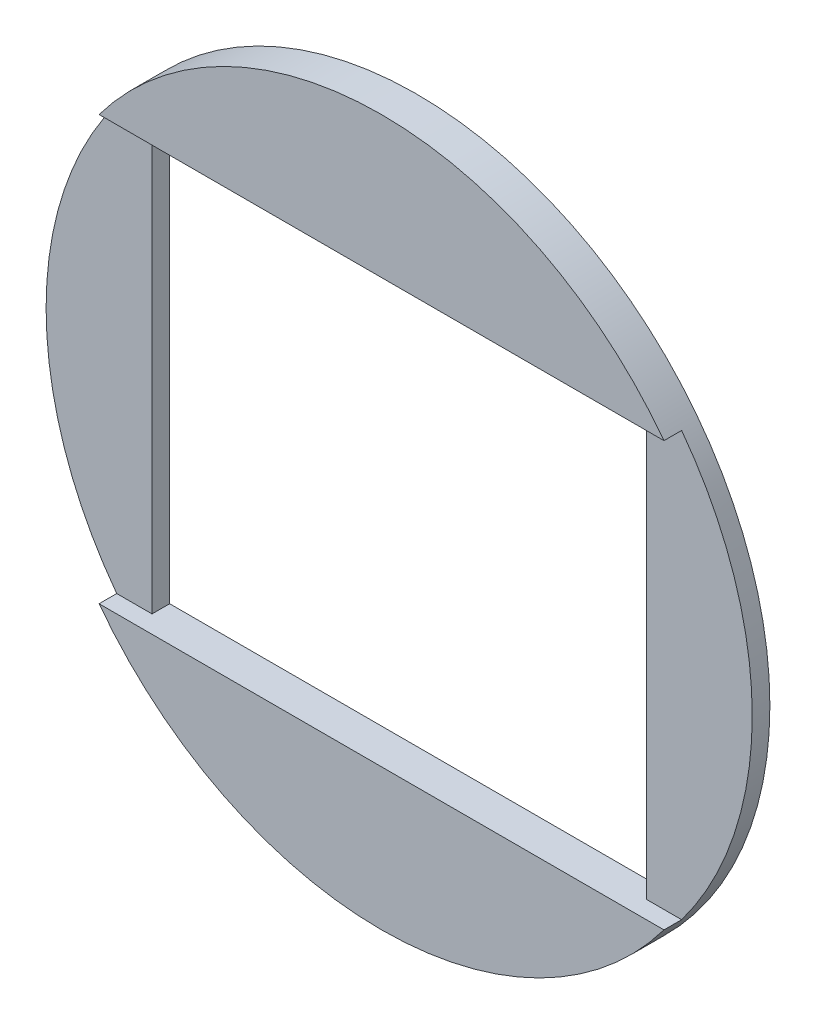
ISO-10303-21;
HEADER;
FILE_DESCRIPTION(('STEP AP214'),'2;1');
FILE_NAME('part.step','',(''),(''),'','','');
FILE_SCHEMA(('AUTOMOTIVE_DESIGN { 1 0 10303 214 1 1 1 1 }'));
ENDSEC;
DATA;
#1=APPLICATION_CONTEXT('core data for automotive mechanical design processes');
#2=APPLICATION_PROTOCOL_DEFINITION('international standard','automotive_design',2000,#1);
#3=PRODUCT_CONTEXT('',#1,'mechanical');
#4=PRODUCT('Part','Part','',(#3));
#5=PRODUCT_RELATED_PRODUCT_CATEGORY('part','',(#4));
#6=PRODUCT_DEFINITION_FORMATION('','',#4);
#7=PRODUCT_DEFINITION_CONTEXT('part definition',#1,'design');
#8=PRODUCT_DEFINITION('design','',#6,#7);
#9=PRODUCT_DEFINITION_SHAPE('','',#8);
#10=(LENGTH_UNIT() NAMED_UNIT(*) SI_UNIT(.MILLI.,.METRE.));
#11=(NAMED_UNIT(*) PLANE_ANGLE_UNIT() SI_UNIT($,.RADIAN.));
#12=(NAMED_UNIT(*) SI_UNIT($,.STERADIAN.) SOLID_ANGLE_UNIT());
#13=UNCERTAINTY_MEASURE_WITH_UNIT(LENGTH_MEASURE(1.E-05),#10,'distance_accuracy_value','');
#14=(GEOMETRIC_REPRESENTATION_CONTEXT(3) GLOBAL_UNCERTAINTY_ASSIGNED_CONTEXT((#13)) GLOBAL_UNIT_ASSIGNED_CONTEXT((#10,
#11,#12)) REPRESENTATION_CONTEXT('',''));
#15=CARTESIAN_POINT('',(0.,0.,0.));
#16=DIRECTION('',(0.,0.,1.));
#17=DIRECTION('',(1.,0.,0.));
#18=AXIS2_PLACEMENT_3D('',#15,#16,#17);
#19=CARTESIAN_POINT('',(0.,0.,1.5875));
#20=DIRECTION('',(0.,0.,1.));
#21=DIRECTION('',(1.,0.,0.));
#22=AXIS2_PLACEMENT_3D('',#19,#20,#21);
#23=PLANE('',#22);
#24=DIRECTION('',(1.,0.,0.));
#25=VECTOR('',#24,1.);
#26=CARTESIAN_POINT('',(0.,19.05,1.5875));
#27=LINE('',#26,#25);
#28=CARTESIAN_POINT('',(-25.4,19.05,1.58749999999999));
#29=VERTEX_POINT('',#28);
#30=CARTESIAN_POINT('',(25.4,19.05,1.58749999999999));
#31=VERTEX_POINT('',#30);
#32=EDGE_CURVE('E102',#29,#31,#27,.T.);
#33=ORIENTED_EDGE('',*,*,#32,.T.);
#34=CARTESIAN_POINT('',(0.,0.,1.5875));
#35=DIRECTION('',(0.,0.,1.));
#36=DIRECTION('',(1.,0.,0.));
#37=AXIS2_PLACEMENT_3D('',#34,#35,#36);
#38=CIRCLE('',#37,31.75);
#39=EDGE_CURVE('E118',#31,#29,#38,.T.);
#40=ORIENTED_EDGE('',*,*,#39,.T.);
#41=EDGE_LOOP('',(#33,#40));
#42=FACE_BOUND('',#41,.T.);
#43=ADVANCED_FACE('F36',(#42),#23,.T.);
#44=CARTESIAN_POINT('',(22.225,0.,1.5875));
#45=DIRECTION('',(-1.,0.,0.));
#46=DIRECTION('',(0.,0.,1.));
#47=AXIS2_PLACEMENT_3D('',#44,#45,#46);
#48=PLANE('',#47);
#49=DIRECTION('',(0.,-1.,0.));
#50=VECTOR('',#49,1.);
#51=CARTESIAN_POINT('',(22.225,0.,0.));
#52=LINE('',#51,#50);
#53=CARTESIAN_POINT('',(22.225,19.05,0.));
#54=VERTEX_POINT('',#53);
#55=CARTESIAN_POINT('',(22.225,-19.05,0.));
#56=VERTEX_POINT('',#55);
#57=EDGE_CURVE('E133',#54,#56,#52,.T.);
#58=ORIENTED_EDGE('',*,*,#57,.F.);
#59=DIRECTION('',(0.,0.,-1.));
#60=VECTOR('',#59,1.);
#61=CARTESIAN_POINT('',(22.225,19.05,1.5875));
#62=LINE('',#61,#60);
#63=CARTESIAN_POINT('',(22.225,19.05,-1.5875));
#64=VERTEX_POINT('',#63);
#65=EDGE_CURVE('E58',#54,#64,#62,.T.);
#66=ORIENTED_EDGE('',*,*,#65,.T.);
#67=DIRECTION('',(0.,1.,0.));
#68=VECTOR('',#67,1.);
#69=CARTESIAN_POINT('',(22.225,0.,-1.5875));
#70=LINE('',#69,#68);
#71=CARTESIAN_POINT('',(22.225,-19.05,-1.5875));
#72=VERTEX_POINT('',#71);
#73=EDGE_CURVE('E129',#72,#64,#70,.T.);
#74=ORIENTED_EDGE('',*,*,#73,.F.);
#75=DIRECTION('',(0.,0.,-1.));
#76=VECTOR('',#75,1.);
#77=CARTESIAN_POINT('',(22.225,-19.05,1.5875));
#78=LINE('',#77,#76);
#79=EDGE_CURVE('E11',#56,#72,#78,.T.);
#80=ORIENTED_EDGE('',*,*,#79,.F.);
#81=EDGE_LOOP('',(#58,#66,#74,#80));
#82=FACE_BOUND('',#81,.T.);
#83=ADVANCED_FACE('F38',(#82),#48,.T.);
#84=CARTESIAN_POINT('',(0.,-19.05,1.5875));
#85=DIRECTION('',(0.,1.,0.));
#86=DIRECTION('',(0.,0.,1.));
#87=AXIS2_PLACEMENT_3D('',#84,#85,#86);
#88=PLANE('',#87);
#89=DIRECTION('',(0.,0.,-1.));
#90=VECTOR('',#89,1.);
#91=CARTESIAN_POINT('',(-22.225,-19.05,1.5875));
#92=LINE('',#91,#90);
#93=CARTESIAN_POINT('',(-22.225,-19.05,0.));
#94=VERTEX_POINT('',#93);
#95=CARTESIAN_POINT('',(-22.225,-19.05,-1.5875));
#96=VERTEX_POINT('',#95);
#97=EDGE_CURVE('E44',#94,#96,#92,.T.);
#98=ORIENTED_EDGE('',*,*,#97,.F.);
#99=DIRECTION('',(-1.,0.,0.));
#100=VECTOR('',#99,1.);
#101=CARTESIAN_POINT('',(31.751,-19.05,0.));
#102=LINE('',#101,#100);
#103=CARTESIAN_POINT('',(-25.4,-19.05,0.));
#104=VERTEX_POINT('',#103);
#105=EDGE_CURVE('E230',#94,#104,#102,.T.);
#106=ORIENTED_EDGE('',*,*,#105,.T.);
#107=DIRECTION('',(0.,0.,-1.));
#108=VECTOR('',#107,1.);
#109=CARTESIAN_POINT('',(-25.4,-19.05,1.5875));
#110=LINE('',#109,#108);
#111=CARTESIAN_POINT('',(-25.4,-19.05,1.5875));
#112=VERTEX_POINT('',#111);
#113=EDGE_CURVE('E122',#112,#104,#110,.T.);
#114=ORIENTED_EDGE('',*,*,#113,.F.);
#115=DIRECTION('',(1.,0.,0.));
#116=VECTOR('',#115,1.);
#117=CARTESIAN_POINT('',(0.,-19.05,1.5875));
#118=LINE('',#117,#116);
#119=CARTESIAN_POINT('',(25.4,-19.05,1.5875));
#120=VERTEX_POINT('',#119);
#121=EDGE_CURVE('E50',#112,#120,#118,.T.);
#122=ORIENTED_EDGE('',*,*,#121,.T.);
#123=DIRECTION('',(0.,0.,-1.));
#124=VECTOR('',#123,1.);
#125=CARTESIAN_POINT('',(25.4,-19.05,1.5875));
#126=LINE('',#125,#124);
#127=CARTESIAN_POINT('',(25.4,-19.05,0.));
#128=VERTEX_POINT('',#127);
#129=EDGE_CURVE('E233',#120,#128,#126,.T.);
#130=ORIENTED_EDGE('',*,*,#129,.T.);
#131=EDGE_CURVE('E161',#128,#56,#102,.T.);
#132=ORIENTED_EDGE('',*,*,#131,.T.);
#133=ORIENTED_EDGE('',*,*,#79,.T.);
#134=DIRECTION('',(1.,0.,0.));
#135=VECTOR('',#134,1.);
#136=CARTESIAN_POINT('',(0.,-19.05,-1.5875));
#137=LINE('',#136,#135);
#138=EDGE_CURVE('E132',#96,#72,#137,.T.);
#139=ORIENTED_EDGE('',*,*,#138,.F.);
#140=EDGE_LOOP('',(#98,#106,#114,#122,#130,#132,#133,#139));
#141=FACE_BOUND('',#140,.T.);
#142=ADVANCED_FACE('F157',(#141),#88,.T.);
#143=CARTESIAN_POINT('',(-22.225,0.,1.5875));
#144=DIRECTION('',(-1.,0.,0.));
#145=DIRECTION('',(0.,0.,1.));
#146=AXIS2_PLACEMENT_3D('',#143,#144,#145);
#147=PLANE('',#146);
#148=DIRECTION('',(0.,0.,-1.));
#149=VECTOR('',#148,1.);
#150=CARTESIAN_POINT('',(-22.225,19.05,1.5875));
#151=LINE('',#150,#149);
#152=CARTESIAN_POINT('',(-22.225,19.05,0.));
#153=VERTEX_POINT('',#152);
#154=CARTESIAN_POINT('',(-22.225,19.05,-1.5875));
#155=VERTEX_POINT('',#154);
#156=EDGE_CURVE('E125',#153,#155,#151,.T.);
#157=ORIENTED_EDGE('',*,*,#156,.F.);
#158=DIRECTION('',(0.,-1.,0.));
#159=VECTOR('',#158,1.);
#160=CARTESIAN_POINT('',(-22.225,0.,0.));
#161=LINE('',#160,#159);
#162=EDGE_CURVE('E151',#153,#94,#161,.T.);
#163=ORIENTED_EDGE('',*,*,#162,.T.);
#164=ORIENTED_EDGE('',*,*,#97,.T.);
#165=DIRECTION('',(0.,1.,0.));
#166=VECTOR('',#165,1.);
#167=CARTESIAN_POINT('',(-22.225,0.,-1.5875));
#168=LINE('',#167,#166);
#169=EDGE_CURVE('E136',#96,#155,#168,.T.);
#170=ORIENTED_EDGE('',*,*,#169,.T.);
#171=EDGE_LOOP('',(#157,#163,#164,#170));
#172=FACE_BOUND('',#171,.T.);
#173=ADVANCED_FACE('F149',(#172),#147,.F.);
#174=CARTESIAN_POINT('',(0.,19.05,1.5875));
#175=DIRECTION('',(0.,1.,0.));
#176=DIRECTION('',(0.,0.,1.));
#177=AXIS2_PLACEMENT_3D('',#174,#175,#176);
#178=PLANE('',#177);
#179=ORIENTED_EDGE('',*,*,#65,.F.);
#180=DIRECTION('',(-1.,0.,0.));
#181=VECTOR('',#180,1.);
#182=CARTESIAN_POINT('',(31.751,19.05,0.));
#183=LINE('',#182,#181);
#184=CARTESIAN_POINT('',(25.4,19.05,0.));
#185=VERTEX_POINT('',#184);
#186=EDGE_CURVE('E227',#185,#54,#183,.T.);
#187=ORIENTED_EDGE('',*,*,#186,.F.);
#188=DIRECTION('',(0.,0.,-1.));
#189=VECTOR('',#188,1.);
#190=CARTESIAN_POINT('',(25.4,19.05,1.5875));
#191=LINE('',#190,#189);
#192=EDGE_CURVE('E109',#185,#31,#191,.F.);
#193=ORIENTED_EDGE('',*,*,#192,.T.);
#194=ORIENTED_EDGE('',*,*,#32,.F.);
#195=DIRECTION('',(0.,0.,-1.));
#196=VECTOR('',#195,1.);
#197=CARTESIAN_POINT('',(-25.4,19.05,1.5875));
#198=LINE('',#197,#196);
#199=CARTESIAN_POINT('',(-25.4,19.05,0.));
#200=VERTEX_POINT('',#199);
#201=EDGE_CURVE('E106',#200,#29,#198,.F.);
#202=ORIENTED_EDGE('',*,*,#201,.F.);
#203=EDGE_CURVE('E226',#153,#200,#183,.T.);
#204=ORIENTED_EDGE('',*,*,#203,.F.);
#205=ORIENTED_EDGE('',*,*,#156,.T.);
#206=DIRECTION('',(1.,0.,0.));
#207=VECTOR('',#206,1.);
#208=CARTESIAN_POINT('',(0.,19.05,-1.5875));
#209=LINE('',#208,#207);
#210=EDGE_CURVE('E139',#155,#64,#209,.T.);
#211=ORIENTED_EDGE('',*,*,#210,.T.);
#212=EDGE_LOOP('',(#179,#187,#193,#194,#202,#204,#205,#211));
#213=FACE_BOUND('',#212,.T.);
#214=ADVANCED_FACE('F104',(#213),#178,.F.);
#215=CARTESIAN_POINT('',(0.,0.,1.5875));
#216=DIRECTION('',(0.,0.,-1.));
#217=DIRECTION('',(-1.,0.,0.));
#218=AXIS2_PLACEMENT_3D('',#215,#216,#217);
#219=CYLINDRICAL_SURFACE('',#218,31.75);
#220=CARTESIAN_POINT('',(0.,0.,0.));
#221=DIRECTION('',(0.,0.,1.));
#222=DIRECTION('',(0.,-1.,0.));
#223=AXIS2_PLACEMENT_3D('',#220,#221,#222);
#224=CIRCLE('',#223,31.75);
#225=EDGE_CURVE('E121',#104,#200,#224,.F.);
#226=ORIENTED_EDGE('',*,*,#225,.T.);
#227=ORIENTED_EDGE('',*,*,#201,.T.);
#228=ORIENTED_EDGE('',*,*,#39,.F.);
#229=ORIENTED_EDGE('',*,*,#192,.F.);
#230=CARTESIAN_POINT('',(0.,0.,0.));
#231=DIRECTION('',(0.,0.,-1.));
#232=DIRECTION('',(0.,1.,0.));
#233=AXIS2_PLACEMENT_3D('',#230,#231,#232);
#234=CIRCLE('',#233,31.75);
#235=EDGE_CURVE('E229',#128,#185,#234,.F.);
#236=ORIENTED_EDGE('',*,*,#235,.F.);
#237=ORIENTED_EDGE('',*,*,#129,.F.);
#238=EDGE_CURVE('E113',#112,#120,#38,.T.);
#239=ORIENTED_EDGE('',*,*,#238,.F.);
#240=ORIENTED_EDGE('',*,*,#113,.T.);
#241=EDGE_LOOP('',(#226,#227,#228,#229,#236,#237,#239,#240));
#242=FACE_BOUND('',#241,.T.);
#243=CARTESIAN_POINT('',(0.,0.,-1.5875));
#244=DIRECTION('',(0.,0.,1.));
#245=DIRECTION('',(1.,0.,0.));
#246=AXIS2_PLACEMENT_3D('',#243,#244,#245);
#247=CIRCLE('',#246,31.75);
#248=CARTESIAN_POINT('',(31.75,0.,-1.5875));
#249=VERTEX_POINT('',#248);
#250=EDGE_CURVE('E141',#249,#249,#247,.T.);
#251=ORIENTED_EDGE('',*,*,#250,.T.);
#252=EDGE_LOOP('',(#251));
#253=FACE_BOUND('',#252,.T.);
#254=ADVANCED_FACE('F116',(#242,#253),#219,.T.);
#255=ORIENTED_EDGE('',*,*,#121,.F.);
#256=ORIENTED_EDGE('',*,*,#238,.T.);
#257=EDGE_LOOP('',(#255,#256));
#258=FACE_BOUND('',#257,.T.);
#259=ADVANCED_FACE('F168',(#258),#23,.T.);
#260=CARTESIAN_POINT('',(0.,0.,-1.5875));
#261=DIRECTION('',(0.,0.,1.));
#262=DIRECTION('',(1.,0.,0.));
#263=AXIS2_PLACEMENT_3D('',#260,#261,#262);
#264=PLANE('',#263);
#265=ORIENTED_EDGE('',*,*,#73,.T.);
#266=ORIENTED_EDGE('',*,*,#210,.F.);
#267=ORIENTED_EDGE('',*,*,#169,.F.);
#268=ORIENTED_EDGE('',*,*,#138,.T.);
#269=EDGE_LOOP('',(#265,#266,#267,#268));
#270=FACE_BOUND('',#269,.T.);
#271=ORIENTED_EDGE('',*,*,#250,.F.);
#272=EDGE_LOOP('',(#271));
#273=FACE_BOUND('',#272,.T.);
#274=ADVANCED_FACE('F155',(#270,#273),#264,.F.);
#275=CARTESIAN_POINT('',(31.751,19.05,0.));
#276=DIRECTION('',(0.,0.,-1.));
#277=DIRECTION('',(0.,1.,0.));
#278=AXIS2_PLACEMENT_3D('',#275,#276,#277);
#279=PLANE('',#278);
#280=ORIENTED_EDGE('',*,*,#57,.T.);
#281=ORIENTED_EDGE('',*,*,#131,.F.);
#282=ORIENTED_EDGE('',*,*,#235,.T.);
#283=ORIENTED_EDGE('',*,*,#186,.T.);
#284=EDGE_LOOP('',(#280,#281,#282,#283));
#285=FACE_BOUND('',#284,.T.);
#286=ADVANCED_FACE('F178',(#285),#279,.F.);
#287=ORIENTED_EDGE('',*,*,#203,.T.);
#288=ORIENTED_EDGE('',*,*,#225,.F.);
#289=ORIENTED_EDGE('',*,*,#105,.F.);
#290=ORIENTED_EDGE('',*,*,#162,.F.);
#291=EDGE_LOOP('',(#287,#288,#289,#290));
#292=FACE_BOUND('',#291,.T.);
#293=ADVANCED_FACE('F214',(#292),#279,.F.);
#294=CLOSED_SHELL('',(#43,#83,#142,#173,#214,#254,#259,#274,#286,#293));
#295=MANIFOLD_SOLID_BREP('B2',#294);
#296=ADVANCED_BREP_SHAPE_REPRESENTATION('',(#18,#295),#14);
#297=SHAPE_DEFINITION_REPRESENTATION(#9,#296);
ENDSEC;
END-ISO-10303-21;
